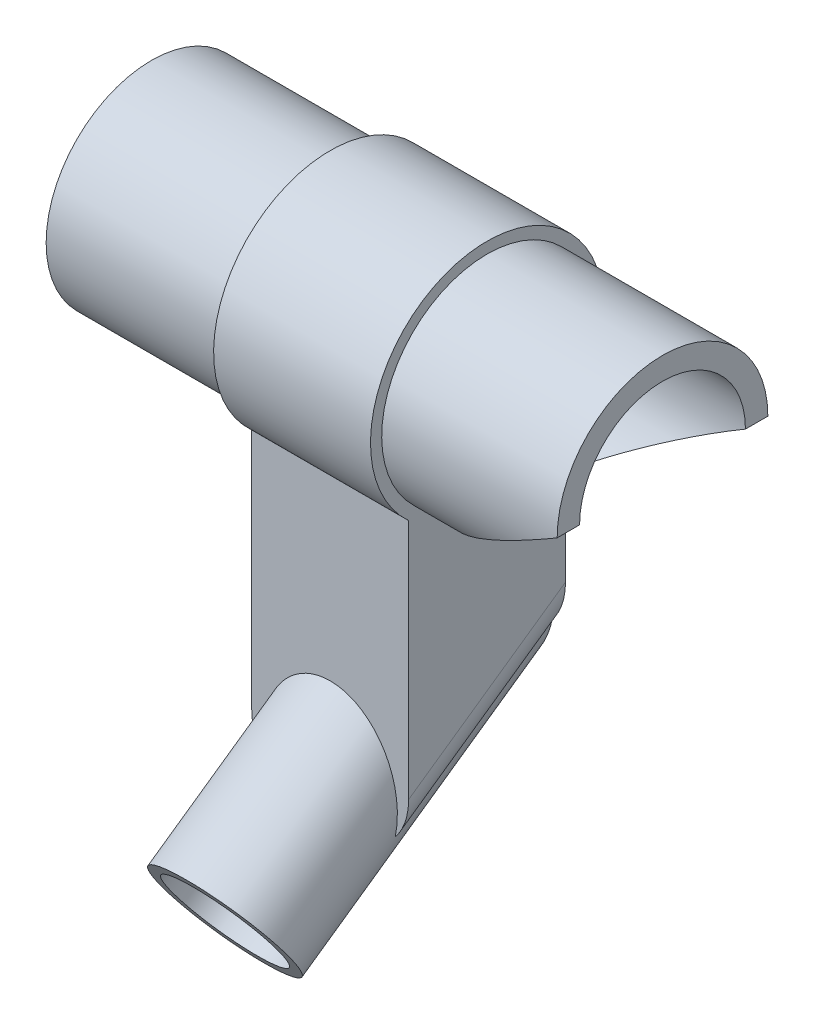
ISO-10303-21;
HEADER;
FILE_DESCRIPTION(('STEP AP214'),'2;1');
FILE_NAME('part.step','',(''),(''),'','','');
FILE_SCHEMA(('AUTOMOTIVE_DESIGN { 1 0 10303 214 1 1 1 1 }'));
ENDSEC;
DATA;
#1=APPLICATION_CONTEXT('core data for automotive mechanical design processes');
#2=APPLICATION_PROTOCOL_DEFINITION('international standard','automotive_design',2000,#1);
#3=PRODUCT_CONTEXT('',#1,'mechanical');
#4=PRODUCT('Part','Part','',(#3));
#5=PRODUCT_RELATED_PRODUCT_CATEGORY('part','',(#4));
#6=PRODUCT_DEFINITION_FORMATION('','',#4);
#7=PRODUCT_DEFINITION_CONTEXT('part definition',#1,'design');
#8=PRODUCT_DEFINITION('design','',#6,#7);
#9=PRODUCT_DEFINITION_SHAPE('','',#8);
#10=(LENGTH_UNIT() NAMED_UNIT(*) SI_UNIT(.MILLI.,.METRE.));
#11=(NAMED_UNIT(*) PLANE_ANGLE_UNIT() SI_UNIT($,.RADIAN.));
#12=(NAMED_UNIT(*) SI_UNIT($,.STERADIAN.) SOLID_ANGLE_UNIT());
#13=UNCERTAINTY_MEASURE_WITH_UNIT(LENGTH_MEASURE(1.E-05),#10,'distance_accuracy_value','');
#14=(GEOMETRIC_REPRESENTATION_CONTEXT(3) GLOBAL_UNCERTAINTY_ASSIGNED_CONTEXT((#13)) GLOBAL_UNIT_ASSIGNED_CONTEXT((#10,
#11,#12)) REPRESENTATION_CONTEXT('',''));
#15=CARTESIAN_POINT('',(0.,0.,0.));
#16=DIRECTION('',(0.,0.,1.));
#17=DIRECTION('',(1.,0.,0.));
#18=AXIS2_PLACEMENT_3D('',#15,#16,#17);
#19=CARTESIAN_POINT('',(114.,0.,0.));
#20=DIRECTION('',(-1.,0.,0.));
#21=DIRECTION('',(0.,0.,1.));
#22=AXIS2_PLACEMENT_3D('',#19,#20,#21);
#23=CYLINDRICAL_SURFACE('',#22,23.5);
#24=CARTESIAN_POINT('',(114.,0.,0.));
#25=DIRECTION('',(-0.506549048630866,0.862211146605728,0.));
#26=DIRECTION('',(-0.862211146605728,-0.506549048630866,0.));
#27=AXIS2_PLACEMENT_3D('',#24,#25,#26);
#28=ELLIPSE('',#27,46.3923485070545,23.5);
#29=CARTESIAN_POINT('',(114.,0.,-23.5));
#30=VERTEX_POINT('',#29);
#31=CARTESIAN_POINT('',(74.857864376269,-22.996004678942,-4.84084381137014));
#32=VERTEX_POINT('',#31);
#33=EDGE_CURVE('E217',#30,#32,#28,.T.);
#34=ORIENTED_EDGE('',*,*,#33,.T.);
#35=CARTESIAN_POINT('',(74.857864376269,0.,0.));
#36=DIRECTION('',(1.,0.,0.));
#37=DIRECTION('',(0.,0.,-1.));
#38=AXIS2_PLACEMENT_3D('',#35,#36,#37);
#39=CIRCLE('',#38,23.5);
#40=CARTESIAN_POINT('',(74.857864376269,-22.996004678942,4.84084381137014));
#41=VERTEX_POINT('',#40);
#42=EDGE_CURVE('E156',#32,#41,#39,.T.);
#43=ORIENTED_EDGE('',*,*,#42,.T.);
#44=CARTESIAN_POINT('',(114.,0.,23.5));
#45=VERTEX_POINT('',#44);
#46=EDGE_CURVE('E212',#41,#45,#28,.T.);
#47=ORIENTED_EDGE('',*,*,#46,.T.);
#48=CARTESIAN_POINT('',(114.,0.,0.));
#49=DIRECTION('',(1.,0.,0.));
#50=DIRECTION('',(0.,0.,-1.));
#51=AXIS2_PLACEMENT_3D('',#48,#49,#50);
#52=CIRCLE('',#51,23.5);
#53=EDGE_CURVE('E209',#30,#45,#52,.T.);
#54=ORIENTED_EDGE('',*,*,#53,.F.);
#55=EDGE_LOOP('',(#34,#43,#47,#54));
#56=FACE_BOUND('',#55,.T.);
#57=ADVANCED_FACE('F41',(#56),#23,.T.);
#58=CARTESIAN_POINT('',(57.3578643762691,-53.5284712729791,-16.3830408857798));
#59=DIRECTION('',(0.,-0.573576436351047,0.819152044288991));
#60=DIRECTION('',(0.,-0.819152044288991,-0.573576436351047));
#61=AXIS2_PLACEMENT_3D('',#58,#59,#60);
#62=CYLINDRICAL_SURFACE('',#61,15.);
#63=DIRECTION('',(0.,-0.573576436351047,0.819152044288991));
#64=VECTOR('',#63,1.);
#65=CARTESIAN_POINT('',(42.8355306649927,-56.6045833726704,-18.5369577663619));
#66=LINE('',#65,#64);
#67=CARTESIAN_POINT('',(42.8355306649925,-81.8379328548221,17.5));
#68=VERTEX_POINT('',#67);
#69=CARTESIAN_POINT('',(42.8355306649927,-57.3306690174822,-17.5));
#70=VERTEX_POINT('',#69);
#71=EDGE_CURVE('E127',#68,#70,#66,.F.);
#72=ORIENTED_EDGE('',*,*,#71,.T.);
#73=CARTESIAN_POINT('',(57.3578643762691,-52.74636808133,-17.5));
#74=DIRECTION('',(0.,0.,1.));
#75=DIRECTION('',(0.,-1.,0.));
#76=AXIS2_PLACEMENT_3D('',#73,#74,#75);
#77=ELLIPSE('',#76,18.3116188314219,15.);
#78=CARTESIAN_POINT('',(71.8829038712057,-57.3178759650481,-17.5));
#79=VERTEX_POINT('',#78);
#80=EDGE_CURVE('E113',#70,#79,#77,.T.);
#81=ORIENTED_EDGE('',*,*,#80,.T.);
#82=DIRECTION('',(0.,-0.573576436351047,0.819152044288991));
#83=VECTOR('',#82,1.);
#84=CARTESIAN_POINT('',(71.8829038712057,-56.5959991056399,-18.530946997877));
#85=LINE('',#84,#83);
#86=CARTESIAN_POINT('',(71.8829038712055,-81.825139802388,17.5));
#87=VERTEX_POINT('',#86);
#88=EDGE_CURVE('E125',#79,#87,#85,.T.);
#89=ORIENTED_EDGE('',*,*,#88,.T.);
#90=CARTESIAN_POINT('',(57.357864376269,-77.25363191867,17.5));
#91=DIRECTION('',(0.,0.,1.));
#92=DIRECTION('',(0.,-1.,0.));
#93=AXIS2_PLACEMENT_3D('',#90,#91,#92);
#94=ELLIPSE('',#93,18.3116188314219,15.);
#95=EDGE_CURVE('E136',#68,#87,#94,.F.);
#96=ORIENTED_EDGE('',*,*,#95,.F.);
#97=EDGE_LOOP('',(#72,#81,#89,#96));
#98=FACE_BOUND('',#97,.T.);
#99=CARTESIAN_POINT('',(57.3578643762689,-93.6788218175524,40.9576022144495));
#100=DIRECTION('',(0.,0.573576436351047,-0.819152044288991));
#101=DIRECTION('',(0.,0.819152044288991,0.573576436351047));
#102=AXIS2_PLACEMENT_3D('',#99,#100,#101);
#103=CIRCLE('',#102,15.);
#104=CARTESIAN_POINT('',(57.3578643762689,-81.3915411532175,49.5612487597153));
#105=VERTEX_POINT('',#104);
#106=EDGE_CURVE('E162',#105,#105,#103,.T.);
#107=ORIENTED_EDGE('',*,*,#106,.T.);
#108=EDGE_LOOP('',(#107));
#109=FACE_BOUND('',#108,.T.);
#110=ADVANCED_FACE('F122',(#98,#109),#62,.T.);
#111=CARTESIAN_POINT('',(57.3578643762691,-53.5284712729791,-16.3830408857798));
#112=DIRECTION('',(0.,-0.573576436351047,0.819152044288991));
#113=DIRECTION('',(0.,-0.819152044288991,-0.573576436351047));
#114=AXIS2_PLACEMENT_3D('',#111,#112,#113);
#115=CYLINDRICAL_SURFACE('',#114,12.5);
#116=CARTESIAN_POINT('',(57.3578643762689,-93.6788218175524,40.9576022144495));
#117=DIRECTION('',(0.,0.573576436351047,-0.819152044288991));
#118=DIRECTION('',(0.,0.819152044288991,0.573576436351047));
#119=AXIS2_PLACEMENT_3D('',#116,#117,#118);
#120=CIRCLE('',#119,12.5);
#121=CARTESIAN_POINT('',(57.3578643762689,-83.43942126394,48.1273076688376));
#122=VERTEX_POINT('',#121);
#123=EDGE_CURVE('E513',#122,#122,#120,.T.);
#124=ORIENTED_EDGE('',*,*,#123,.F.);
#125=EDGE_LOOP('',(#124));
#126=FACE_BOUND('',#125,.T.);
#127=CARTESIAN_POINT('',(57.357864376269,-77.25363191867,17.5));
#128=DIRECTION('',(0.,0.,1.));
#129=DIRECTION('',(0.,-1.,0.));
#130=AXIS2_PLACEMENT_3D('',#127,#128,#129);
#131=ELLIPSE('',#130,15.2596823595182,12.5);
#132=CARTESIAN_POINT('',(57.3578643762689,-92.5133142781882,17.5));
#133=VERTEX_POINT('',#132);
#134=EDGE_CURVE('E228',#133,#133,#131,.F.);
#135=ORIENTED_EDGE('',*,*,#134,.T.);
#136=EDGE_LOOP('',(#135));
#137=FACE_BOUND('',#136,.T.);
#138=ADVANCED_FACE('F249',(#126,#137),#115,.F.);
#139=CARTESIAN_POINT('',(39.857864376269,-65.,17.5));
#140=DIRECTION('',(0.,0.,1.));
#141=DIRECTION('',(1.,0.,0.));
#142=AXIS2_PLACEMENT_3D('',#139,#140,#141);
#143=PLANE('',#142);
#144=ORIENTED_EDGE('',*,*,#134,.F.);
#145=EDGE_LOOP('',(#144));
#146=FACE_BOUND('',#145,.T.);
#147=ADVANCED_FACE('F275',(#146),#143,.T.);
#148=CARTESIAN_POINT('',(5.,0.,0.));
#149=DIRECTION('',(-1.,0.,0.));
#150=DIRECTION('',(0.,0.,1.));
#151=AXIS2_PLACEMENT_3D('',#148,#149,#150);
#152=CYLINDRICAL_SURFACE('',#151,5.37499999999997);
#153=CARTESIAN_POINT('',(0.,0.,0.));
#154=DIRECTION('',(-1.,0.,0.));
#155=DIRECTION('',(0.,0.,1.));
#156=AXIS2_PLACEMENT_3D('',#153,#154,#155);
#157=CIRCLE('',#156,5.37499999999997);
#158=CARTESIAN_POINT('',(0.,0.,5.37499999999997));
#159=VERTEX_POINT('',#158);
#160=EDGE_CURVE('E199',#159,#159,#157,.T.);
#161=ORIENTED_EDGE('',*,*,#160,.T.);
#162=EDGE_LOOP('',(#161));
#163=FACE_BOUND('',#162,.T.);
#164=CARTESIAN_POINT('',(2.5,0.,0.));
#165=DIRECTION('',(1.,0.,0.));
#166=DIRECTION('',(0.,0.,-1.));
#167=AXIS2_PLACEMENT_3D('',#164,#165,#166);
#168=CIRCLE('',#167,5.37499999999997);
#169=CARTESIAN_POINT('',(2.5,0.,-5.37499999999997));
#170=VERTEX_POINT('',#169);
#171=EDGE_CURVE('E169',#170,#170,#168,.F.);
#172=ORIENTED_EDGE('',*,*,#171,.F.);
#173=EDGE_LOOP('',(#172));
#174=FACE_BOUND('',#173,.T.);
#175=ADVANCED_FACE('F309',(#163,#174),#152,.F.);
#176=CARTESIAN_POINT('',(114.,0.,0.));
#177=DIRECTION('',(-1.,0.,0.));
#178=DIRECTION('',(0.,0.,1.));
#179=AXIS2_PLACEMENT_3D('',#176,#177,#178);
#180=CYLINDRICAL_SURFACE('',#179,18.5);
#181=CARTESIAN_POINT('',(5.,0.,0.));
#182=DIRECTION('',(-1.,0.,0.));
#183=DIRECTION('',(0.,0.,1.));
#184=AXIS2_PLACEMENT_3D('',#181,#182,#183);
#185=CIRCLE('',#184,18.5);
#186=CARTESIAN_POINT('',(5.,0.,18.5));
#187=VERTEX_POINT('',#186);
#188=EDGE_CURVE('E204',#187,#187,#185,.T.);
#189=ORIENTED_EDGE('',*,*,#188,.T.);
#190=EDGE_LOOP('',(#189));
#191=FACE_BOUND('',#190,.T.);
#192=CARTESIAN_POINT('',(114.,0.,0.));
#193=DIRECTION('',(-0.506549048630866,0.862211146605728,0.));
#194=DIRECTION('',(-0.862211146605728,-0.506549048630866,0.));
#195=AXIS2_PLACEMENT_3D('',#192,#193,#194);
#196=ELLIPSE('',#195,36.521636058745,18.5);
#197=CARTESIAN_POINT('',(114.,0.,-18.5));
#198=VERTEX_POINT('',#197);
#199=CARTESIAN_POINT('',(114.,0.,18.5));
#200=VERTEX_POINT('',#199);
#201=EDGE_CURVE('E174',#198,#200,#196,.T.);
#202=ORIENTED_EDGE('',*,*,#201,.F.);
#203=CARTESIAN_POINT('',(114.,0.,0.));
#204=DIRECTION('',(1.,0.,0.));
#205=DIRECTION('',(0.,0.,-1.));
#206=AXIS2_PLACEMENT_3D('',#203,#204,#205);
#207=CIRCLE('',#206,18.5);
#208=EDGE_CURVE('E205',#198,#200,#207,.T.);
#209=ORIENTED_EDGE('',*,*,#208,.T.);
#210=EDGE_LOOP('',(#202,#209));
#211=FACE_BOUND('',#210,.T.);
#212=ADVANCED_FACE('F311',(#191,#211),#180,.F.);
#213=CARTESIAN_POINT('',(114.,0.,0.));
#214=DIRECTION('',(1.,0.,0.));
#215=DIRECTION('',(0.,0.,-1.));
#216=AXIS2_PLACEMENT_3D('',#213,#214,#215);
#217=PLANE('',#216);
#218=DIRECTION('',(0.,0.,1.));
#219=VECTOR('',#218,1.);
#220=CARTESIAN_POINT('',(114.,0.,-23.5));
#221=LINE('',#220,#219);
#222=EDGE_CURVE('E172',#30,#198,#221,.T.);
#223=ORIENTED_EDGE('',*,*,#222,.F.);
#224=ORIENTED_EDGE('',*,*,#53,.T.);
#225=EDGE_CURVE('E175',#200,#45,#221,.T.);
#226=ORIENTED_EDGE('',*,*,#225,.F.);
#227=ORIENTED_EDGE('',*,*,#208,.F.);
#228=EDGE_LOOP('',(#223,#224,#226,#227));
#229=FACE_BOUND('',#228,.T.);
#230=ADVANCED_FACE('F263',(#229),#217,.T.);
#231=CARTESIAN_POINT('',(0.,0.,0.));
#232=DIRECTION('',(1.,0.,0.));
#233=DIRECTION('',(0.,0.,-1.));
#234=AXIS2_PLACEMENT_3D('',#231,#232,#233);
#235=PLANE('',#234);
#236=CARTESIAN_POINT('',(0.,0.,0.));
#237=DIRECTION('',(1.,0.,0.));
#238=DIRECTION('',(0.,0.,-1.));
#239=AXIS2_PLACEMENT_3D('',#236,#237,#238);
#240=CIRCLE('',#239,23.5);
#241=CARTESIAN_POINT('',(0.,0.,23.5));
#242=VERTEX_POINT('',#241);
#243=EDGE_CURVE('E208',#242,#242,#240,.T.);
#244=ORIENTED_EDGE('',*,*,#243,.F.);
#245=EDGE_LOOP('',(#244));
#246=FACE_BOUND('',#245,.T.);
#247=ORIENTED_EDGE('',*,*,#160,.F.);
#248=EDGE_LOOP('',(#247));
#249=FACE_BOUND('',#248,.T.);
#250=CARTESIAN_POINT('',(0.,6.35166331923901,-12.4762323269907));
#251=DIRECTION('',(-1.,0.,0.));
#252=DIRECTION('',(0.,0.,1.));
#253=AXIS2_PLACEMENT_3D('',#250,#251,#252);
#254=CIRCLE('',#253,1.24999999999999);
#255=CARTESIAN_POINT('',(0.,6.35166331923901,-11.2262323269907));
#256=VERTEX_POINT('',#255);
#257=EDGE_CURVE('E193',#256,#256,#254,.T.);
#258=ORIENTED_EDGE('',*,*,#257,.F.);
#259=EDGE_LOOP('',(#258));
#260=FACE_BOUND('',#259,.T.);
#261=CARTESIAN_POINT('',(0.,-12.4762323270948,-6.35166331923473));
#262=DIRECTION('',(-1.,0.,0.));
#263=DIRECTION('',(0.,0.,1.));
#264=AXIS2_PLACEMENT_3D('',#261,#262,#263);
#265=CIRCLE('',#264,1.24999999999999);
#266=CARTESIAN_POINT('',(0.,-12.4762323270948,-5.10166331923475));
#267=VERTEX_POINT('',#266);
#268=EDGE_CURVE('E187',#267,#267,#265,.T.);
#269=ORIENTED_EDGE('',*,*,#268,.F.);
#270=EDGE_LOOP('',(#269));
#271=FACE_BOUND('',#270,.T.);
#272=CARTESIAN_POINT('',(0.,-6.35166331933882,12.4762323270991));
#273=DIRECTION('',(-1.,0.,0.));
#274=DIRECTION('',(0.,0.,1.));
#275=AXIS2_PLACEMENT_3D('',#272,#273,#274);
#276=CIRCLE('',#275,1.24999999999999);
#277=CARTESIAN_POINT('',(0.,-6.35166331933882,13.726232327099));
#278=VERTEX_POINT('',#277);
#279=EDGE_CURVE('E181',#278,#278,#276,.T.);
#280=ORIENTED_EDGE('',*,*,#279,.F.);
#281=EDGE_LOOP('',(#280));
#282=FACE_BOUND('',#281,.T.);
#283=CARTESIAN_POINT('',(0.,12.476232326995,6.35166331934309));
#284=DIRECTION('',(-1.,0.,0.));
#285=DIRECTION('',(0.,0.,1.));
#286=AXIS2_PLACEMENT_3D('',#283,#284,#285);
#287=CIRCLE('',#286,1.24999999999999);
#288=CARTESIAN_POINT('',(0.,12.476232326995,7.60166331934308));
#289=VERTEX_POINT('',#288);
#290=EDGE_CURVE('E177',#289,#289,#287,.T.);
#291=ORIENTED_EDGE('',*,*,#290,.F.);
#292=EDGE_LOOP('',(#291));
#293=FACE_BOUND('',#292,.T.);
#294=ADVANCED_FACE('F253',(#246,#249,#260,#271,#282,#293),#235,.F.);
#295=CARTESIAN_POINT('',(39.857864376269,0.,0.));
#296=DIRECTION('',(-1.,0.,0.));
#297=DIRECTION('',(0.,0.,1.));
#298=AXIS2_PLACEMENT_3D('',#295,#296,#297);
#299=CIRCLE('',#298,23.5);
#300=CARTESIAN_POINT('',(39.8578643762691,0.,23.5));
#301=VERTEX_POINT('',#300);
#302=EDGE_CURVE('E225',#301,#301,#299,.T.);
#303=CARTESIAN_POINT('',(0.,0.,23.5));
#304=CARTESIAN_POINT('',(0.415186087252805,0.,23.5));
#305=CARTESIAN_POINT('',(0.83037217450561,0.,23.5));
#306=CARTESIAN_POINT('',(1.66074434901121,0.,23.5));
#307=CARTESIAN_POINT('',(2.07593043626401,0.,23.5));
#308=CARTESIAN_POINT('',(2.90630261076962,0.,23.5));
#309=CARTESIAN_POINT('',(3.32148869802242,0.,23.5));
#310=CARTESIAN_POINT('',(4.15186087252803,0.,23.5));
#311=CARTESIAN_POINT('',(4.56704695978083,0.,23.5));
#312=CARTESIAN_POINT('',(5.39741913428643,0.,23.5));
#313=CARTESIAN_POINT('',(5.81260522153924,0.,23.5));
#314=CARTESIAN_POINT('',(6.64297739604484,0.,23.5));
#315=CARTESIAN_POINT('',(7.05816348329764,0.,23.5));
#316=CARTESIAN_POINT('',(7.88853565780325,0.,23.5));
#317=CARTESIAN_POINT('',(8.30372174505605,0.,23.5));
#318=CARTESIAN_POINT('',(9.13409391956166,0.,23.5));
#319=CARTESIAN_POINT('',(9.54928000681446,0.,23.5));
#320=CARTESIAN_POINT('',(10.3796521813201,0.,23.5));
#321=CARTESIAN_POINT('',(10.7948382685729,0.,23.5));
#322=CARTESIAN_POINT('',(11.6252104430785,0.,23.5));
#323=CARTESIAN_POINT('',(12.0403965303313,0.,23.5));
#324=CARTESIAN_POINT('',(12.8707687048369,0.,23.5));
#325=CARTESIAN_POINT('',(13.2859547920897,0.,23.5));
#326=CARTESIAN_POINT('',(14.1163269665953,0.,23.5));
#327=CARTESIAN_POINT('',(14.5315130538481,0.,23.5));
#328=CARTESIAN_POINT('',(15.3618852283537,0.,23.5));
#329=CARTESIAN_POINT('',(15.7770713156065,0.,23.5));
#330=CARTESIAN_POINT('',(16.6074434901121,0.,23.5));
#331=CARTESIAN_POINT('',(17.0226295773649,0.,23.5));
#332=CARTESIAN_POINT('',(17.8530017518705,0.,23.5));
#333=CARTESIAN_POINT('',(18.2681878391233,0.,23.5));
#334=CARTESIAN_POINT('',(19.0985600136289,0.,23.5));
#335=CARTESIAN_POINT('',(19.5137461008817,0.,23.5));
#336=CARTESIAN_POINT('',(20.3441182753873,0.,23.5));
#337=CARTESIAN_POINT('',(20.7593043626401,0.,23.5));
#338=CARTESIAN_POINT('',(21.5896765371457,0.,23.5));
#339=CARTESIAN_POINT('',(22.0048626243985,0.,23.5));
#340=CARTESIAN_POINT('',(22.8352347989041,0.,23.5));
#341=CARTESIAN_POINT('',(23.250420886157,0.,23.5));
#342=CARTESIAN_POINT('',(24.0807930606626,0.,23.5));
#343=CARTESIAN_POINT('',(24.4959791479154,0.,23.5));
#344=CARTESIAN_POINT('',(25.326351322421,0.,23.5));
#345=CARTESIAN_POINT('',(25.7415374096738,0.,23.5));
#346=CARTESIAN_POINT('',(26.5719095841794,0.,23.5));
#347=CARTESIAN_POINT('',(26.9870956714322,0.,23.5));
#348=CARTESIAN_POINT('',(27.8174678459378,0.,23.5));
#349=CARTESIAN_POINT('',(28.2326539331906,0.,23.5));
#350=CARTESIAN_POINT('',(29.0630261076962,0.,23.5));
#351=CARTESIAN_POINT('',(29.478212194949,0.,23.5));
#352=CARTESIAN_POINT('',(30.3085843694546,0.,23.5));
#353=CARTESIAN_POINT('',(30.7237704567074,0.,23.5));
#354=CARTESIAN_POINT('',(31.554142631213,0.,23.5));
#355=CARTESIAN_POINT('',(31.9693287184658,0.,23.5));
#356=CARTESIAN_POINT('',(32.7997008929714,0.,23.5));
#357=CARTESIAN_POINT('',(33.2148869802242,0.,23.5));
#358=CARTESIAN_POINT('',(34.0452591547298,0.,23.5));
#359=CARTESIAN_POINT('',(34.4604452419826,0.,23.5));
#360=CARTESIAN_POINT('',(35.2908174164882,0.,23.5));
#361=CARTESIAN_POINT('',(35.706003503741,0.,23.5));
#362=CARTESIAN_POINT('',(36.5363756782466,0.,23.5));
#363=CARTESIAN_POINT('',(36.9515617654994,0.,23.5));
#364=CARTESIAN_POINT('',(37.7819339400051,0.,23.5));
#365=CARTESIAN_POINT('',(38.1971200272579,0.,23.5));
#366=CARTESIAN_POINT('',(39.0274922017635,0.,23.5));
#367=CARTESIAN_POINT('',(39.4426782890163,0.,23.5));
#368=CARTESIAN_POINT('',(39.8578643762691,0.,23.5));
#369=B_SPLINE_CURVE_WITH_KNOTS('',3,(#303,#304,#305,#306,#307,#308,#309,#310,#311,#312,#313,
#314,#315,#316,#317,#318,#319,#320,#321,#322,#323,#324,#325,#326,#327,#328,#329,#330,#331,#332,
#333,#334,#335,#336,#337,#338,#339,#340,#341,#342,#343,#344,#345,#346,#347,#348,#349,#350,#351,
#352,#353,#354,#355,#356,#357,#358,#359,#360,#361,#362,#363,#364,#365,#366,#367,#368),
.UNSPECIFIED.,.F.,.F.,(4,2,2,2,2,2,2,2,2,2,2,2,2,2,2,2,2,2,2,2,2,2,2,2,2,2,2,2,2,2,2,2,4),(0.,
1.24555826175841,2.49111652351681,3.73667478527523,4.98223304703363,6.22779130879204,
7.47334957055044,8.71890783230886,9.96446609406726,11.2100243558257,12.4555826175841,
13.7011408793425,14.9466991411009,16.1922574028593,17.4378156646177,18.6833739263761,
19.9289321881345,21.1744904498929,22.4200487116513,23.6656069734098,24.9111652351682,
26.1567234969266,27.402281758685,28.6478400204434,29.8933982822018,31.1389565439602,
32.3845148057186,33.630073067477,34.8756313292354,36.1211895909938,37.3667478527522,
38.6123061145107,39.8578643762691),.UNSPECIFIED.);
#370=EDGE_CURVE('BSEAM243',#242,#301,#369,.T.);
#371=ORIENTED_EDGE('',*,*,#243,.T.);
#372=ORIENTED_EDGE('',*,*,#302,.T.);
#373=ORIENTED_EDGE('',*,*,#370,.T.);
#374=ORIENTED_EDGE('',*,*,#370,.F.);
#375=EDGE_LOOP('',(#371,#373,#372,#374));
#376=FACE_BOUND('',#375,.T.);
#377=ADVANCED_FACE('F243',(#376),#23,.T.);
#378=CARTESIAN_POINT('',(5.,0.,0.));
#379=DIRECTION('',(-1.,0.,0.));
#380=DIRECTION('',(0.,0.,1.));
#381=AXIS2_PLACEMENT_3D('',#378,#379,#380);
#382=PLANE('',#381);
#383=CARTESIAN_POINT('',(5.,-4.99034579325564E-11,5.41864209752108E-11));
#384=DIRECTION('',(1.,0.,0.));
#385=DIRECTION('',(0.,0.,-1.));
#386=AXIS2_PLACEMENT_3D('',#383,#384,#385);
#387=CIRCLE('',#386,11.5000000000663);
#388=CARTESIAN_POINT('',(5.,-4.99034579325564E-11,-11.5000000000121));
#389=VERTEX_POINT('',#388);
#390=EDGE_CURVE('E165',#389,#389,#387,.T.);
#391=ORIENTED_EDGE('',*,*,#390,.F.);
#392=EDGE_LOOP('',(#391));
#393=FACE_BOUND('',#392,.T.);
#394=CARTESIAN_POINT('',(5.,6.35166331923901,-12.4762323269907));
#395=DIRECTION('',(-1.,0.,0.));
#396=DIRECTION('',(0.,0.,1.));
#397=AXIS2_PLACEMENT_3D('',#394,#395,#396);
#398=CIRCLE('',#397,1.24999999999999);
#399=CARTESIAN_POINT('',(5.,6.35166331923901,-11.2262323269907));
#400=VERTEX_POINT('',#399);
#401=EDGE_CURVE('E196',#400,#400,#398,.T.);
#402=ORIENTED_EDGE('',*,*,#401,.T.);
#403=EDGE_LOOP('',(#402));
#404=FACE_BOUND('',#403,.T.);
#405=CARTESIAN_POINT('',(5.,-12.4762323270948,-6.35166331923473));
#406=DIRECTION('',(-1.,0.,0.));
#407=DIRECTION('',(0.,0.,1.));
#408=AXIS2_PLACEMENT_3D('',#405,#406,#407);
#409=CIRCLE('',#408,1.24999999999999);
#410=CARTESIAN_POINT('',(5.,-12.4762323270948,-5.10166331923475));
#411=VERTEX_POINT('',#410);
#412=EDGE_CURVE('E190',#411,#411,#409,.T.);
#413=ORIENTED_EDGE('',*,*,#412,.T.);
#414=EDGE_LOOP('',(#413));
#415=FACE_BOUND('',#414,.T.);
#416=CARTESIAN_POINT('',(5.,-6.35166331933882,12.4762323270991));
#417=DIRECTION('',(-1.,0.,0.));
#418=DIRECTION('',(0.,0.,1.));
#419=AXIS2_PLACEMENT_3D('',#416,#417,#418);
#420=CIRCLE('',#419,1.24999999999999);
#421=CARTESIAN_POINT('',(5.,-6.35166331933882,13.726232327099));
#422=VERTEX_POINT('',#421);
#423=EDGE_CURVE('E184',#422,#422,#420,.T.);
#424=ORIENTED_EDGE('',*,*,#423,.T.);
#425=EDGE_LOOP('',(#424));
#426=FACE_BOUND('',#425,.T.);
#427=CARTESIAN_POINT('',(5.,12.476232326995,6.35166331934309));
#428=DIRECTION('',(-1.,0.,0.));
#429=DIRECTION('',(0.,0.,1.));
#430=AXIS2_PLACEMENT_3D('',#427,#428,#429);
#431=CIRCLE('',#430,1.24999999999999);
#432=CARTESIAN_POINT('',(5.,12.476232326995,7.60166331934308));
#433=VERTEX_POINT('',#432);
#434=EDGE_CURVE('E178',#433,#433,#431,.T.);
#435=ORIENTED_EDGE('',*,*,#434,.T.);
#436=EDGE_LOOP('',(#435));
#437=FACE_BOUND('',#436,.T.);
#438=ORIENTED_EDGE('',*,*,#188,.F.);
#439=EDGE_LOOP('',(#438));
#440=FACE_BOUND('',#439,.T.);
#441=ADVANCED_FACE('F252',(#393,#404,#415,#426,#437,#440),#382,.F.);
#442=CARTESIAN_POINT('',(5.,6.35166331923901,-12.4762323269907));
#443=DIRECTION('',(-1.,0.,0.));
#444=DIRECTION('',(0.,0.,1.));
#445=AXIS2_PLACEMENT_3D('',#442,#443,#444);
#446=CYLINDRICAL_SURFACE('',#445,1.24999999999999);
#447=ORIENTED_EDGE('',*,*,#401,.F.);
#448=EDGE_LOOP('',(#447));
#449=FACE_BOUND('',#448,.T.);
#450=ORIENTED_EDGE('',*,*,#257,.T.);
#451=EDGE_LOOP('',(#450));
#452=FACE_BOUND('',#451,.T.);
#453=ADVANCED_FACE('F259',(#449,#452),#446,.F.);
#454=CARTESIAN_POINT('',(5.,-12.4762323270948,-6.35166331923473));
#455=DIRECTION('',(-1.,0.,0.));
#456=DIRECTION('',(0.,0.,1.));
#457=AXIS2_PLACEMENT_3D('',#454,#455,#456);
#458=CYLINDRICAL_SURFACE('',#457,1.24999999999999);
#459=ORIENTED_EDGE('',*,*,#412,.F.);
#460=EDGE_LOOP('',(#459));
#461=FACE_BOUND('',#460,.T.);
#462=ORIENTED_EDGE('',*,*,#268,.T.);
#463=EDGE_LOOP('',(#462));
#464=FACE_BOUND('',#463,.T.);
#465=ADVANCED_FACE('F301',(#461,#464),#458,.F.);
#466=CARTESIAN_POINT('',(5.,-6.35166331933882,12.4762323270991));
#467=DIRECTION('',(-1.,0.,0.));
#468=DIRECTION('',(0.,0.,1.));
#469=AXIS2_PLACEMENT_3D('',#466,#467,#468);
#470=CYLINDRICAL_SURFACE('',#469,1.24999999999999);
#471=ORIENTED_EDGE('',*,*,#423,.F.);
#472=EDGE_LOOP('',(#471));
#473=FACE_BOUND('',#472,.T.);
#474=ORIENTED_EDGE('',*,*,#279,.T.);
#475=EDGE_LOOP('',(#474));
#476=FACE_BOUND('',#475,.T.);
#477=ADVANCED_FACE('F297',(#473,#476),#470,.F.);
#478=CARTESIAN_POINT('',(5.,12.476232326995,6.35166331934309));
#479=DIRECTION('',(-1.,0.,0.));
#480=DIRECTION('',(0.,0.,1.));
#481=AXIS2_PLACEMENT_3D('',#478,#479,#480);
#482=CYLINDRICAL_SURFACE('',#481,1.24999999999999);
#483=ORIENTED_EDGE('',*,*,#434,.F.);
#484=EDGE_LOOP('',(#483));
#485=FACE_BOUND('',#484,.T.);
#486=ORIENTED_EDGE('',*,*,#290,.T.);
#487=EDGE_LOOP('',(#486));
#488=FACE_BOUND('',#487,.T.);
#489=ADVANCED_FACE('F293',(#485,#488),#482,.F.);
#490=CARTESIAN_POINT('',(114.,0.,-23.5));
#491=DIRECTION('',(-0.506549048630866,0.862211146605728,0.));
#492=DIRECTION('',(-0.862211146605728,-0.506549048630866,0.));
#493=AXIS2_PLACEMENT_3D('',#490,#491,#492);
#494=PLANE('',#493);
#495=ORIENTED_EDGE('',*,*,#46,.F.);
#496=DIRECTION('',(0.,0.,-1.));
#497=VECTOR('',#496,1.);
#498=CARTESIAN_POINT('',(74.857864376269,-22.996004678942,-23.5));
#499=LINE('',#498,#497);
#500=EDGE_CURVE('E220',#41,#32,#499,.T.);
#501=ORIENTED_EDGE('',*,*,#500,.T.);
#502=ORIENTED_EDGE('',*,*,#33,.F.);
#503=ORIENTED_EDGE('',*,*,#222,.T.);
#504=ORIENTED_EDGE('',*,*,#201,.T.);
#505=ORIENTED_EDGE('',*,*,#225,.T.);
#506=EDGE_LOOP('',(#495,#501,#502,#503,#504,#505));
#507=FACE_BOUND('',#506,.T.);
#508=ADVANCED_FACE('F286',(#507),#494,.F.);
#509=CARTESIAN_POINT('',(2.5,-4.99034579325564E-11,5.41864209752108E-11));
#510=DIRECTION('',(1.,0.,0.));
#511=DIRECTION('',(0.,0.,-1.));
#512=AXIS2_PLACEMENT_3D('',#509,#510,#511);
#513=PLANE('',#512);
#514=CARTESIAN_POINT('',(2.5,-4.99034579325564E-11,5.41864209752108E-11));
#515=DIRECTION('',(1.,0.,0.));
#516=DIRECTION('',(0.,0.,-1.));
#517=AXIS2_PLACEMENT_3D('',#514,#515,#516);
#518=CIRCLE('',#517,11.5000000000663);
#519=CARTESIAN_POINT('',(2.5,-4.99034579325564E-11,-11.5000000000121));
#520=VERTEX_POINT('',#519);
#521=EDGE_CURVE('E166',#520,#520,#518,.T.);
#522=ORIENTED_EDGE('',*,*,#521,.T.);
#523=EDGE_LOOP('',(#522));
#524=FACE_BOUND('',#523,.T.);
#525=ORIENTED_EDGE('',*,*,#171,.T.);
#526=EDGE_LOOP('',(#525));
#527=FACE_BOUND('',#526,.T.);
#528=ADVANCED_FACE('F283',(#524,#527),#513,.T.);
#529=CARTESIAN_POINT('',(2.5,-4.99034579325564E-11,5.41864209752108E-11));
#530=DIRECTION('',(1.,0.,0.));
#531=DIRECTION('',(0.,0.,-1.));
#532=AXIS2_PLACEMENT_3D('',#529,#530,#531);
#533=CYLINDRICAL_SURFACE('',#532,11.5000000000663);
#534=ORIENTED_EDGE('',*,*,#521,.F.);
#535=EDGE_LOOP('',(#534));
#536=FACE_BOUND('',#535,.T.);
#537=ORIENTED_EDGE('',*,*,#390,.T.);
#538=EDGE_LOOP('',(#537));
#539=FACE_BOUND('',#538,.T.);
#540=ADVANCED_FACE('F281',(#536,#539),#533,.F.);
#541=CARTESIAN_POINT('',(74.857864376269,-65.,-17.5));
#542=DIRECTION('',(1.,0.,0.));
#543=DIRECTION('',(0.,0.,-1.));
#544=AXIS2_PLACEMENT_3D('',#541,#542,#543);
#545=PLANE('',#544);
#546=DIRECTION('',(0.,1.,0.));
#547=VECTOR('',#546,1.);
#548=CARTESIAN_POINT('',(74.857864376269,-65.,-17.5));
#549=LINE('',#548,#547);
#550=CARTESIAN_POINT('',(74.857864376269,-48.6298692710991,-17.5));
#551=VERTEX_POINT('',#550);
#552=CARTESIAN_POINT('',(74.857864376269,-19.2288845230294,-17.5));
#553=VERTEX_POINT('',#552);
#554=EDGE_CURVE('E115',#551,#553,#549,.T.);
#555=ORIENTED_EDGE('',*,*,#554,.T.);
#556=CARTESIAN_POINT('',(74.857864376269,0.,0.));
#557=DIRECTION('',(-1.,0.,0.));
#558=DIRECTION('',(0.,0.,1.));
#559=AXIS2_PLACEMENT_3D('',#556,#557,#558);
#560=CIRCLE('',#559,26.);
#561=CARTESIAN_POINT('',(74.857864376269,-19.2288845230294,17.5));
#562=VERTEX_POINT('',#561);
#563=EDGE_CURVE('E517',#562,#553,#560,.T.);
#564=ORIENTED_EDGE('',*,*,#563,.F.);
#565=DIRECTION('',(0.,1.,0.));
#566=VECTOR('',#565,1.);
#567=CARTESIAN_POINT('',(74.857864376269,-65.,17.5));
#568=LINE('',#567,#566);
#569=CARTESIAN_POINT('',(74.8578643762689,-73.137133108439,17.5));
#570=VERTEX_POINT('',#569);
#571=EDGE_CURVE('E154',#570,#562,#568,.T.);
#572=ORIENTED_EDGE('',*,*,#571,.F.);
#573=DIRECTION('',(0.,0.573576436351047,-0.819152044288991));
#574=VECTOR('',#573,1.);
#575=CARTESIAN_POINT('',(74.857864376269,-50.5619493105363,-14.7407037428115));
#576=LINE('',#575,#574);
#577=EDGE_CURVE('E133',#570,#551,#576,.T.);
#578=ORIENTED_EDGE('',*,*,#577,.T.);
#579=EDGE_LOOP('',(#555,#564,#572,#578));
#580=FACE_BOUND('',#579,.T.);
#581=ORIENTED_EDGE('',*,*,#42,.F.);
#582=ORIENTED_EDGE('',*,*,#500,.F.);
#583=EDGE_LOOP('',(#581,#582));
#584=FACE_BOUND('',#583,.T.);
#585=ADVANCED_FACE('F276',(#580,#584),#545,.T.);
#586=CARTESIAN_POINT('',(39.857864376269,-65.,-17.5));
#587=DIRECTION('',(0.,0.,-1.));
#588=DIRECTION('',(-1.,0.,0.));
#589=AXIS2_PLACEMENT_3D('',#586,#587,#588);
#590=PLANE('',#589);
#591=DIRECTION('',(-1.,0.,0.));
#592=VECTOR('',#591,1.);
#593=CARTESIAN_POINT('',(74.857864376269,-19.2288845230294,-17.5));
#594=LINE('',#593,#592);
#595=CARTESIAN_POINT('',(39.857864376269,-19.2288845230294,-17.5));
#596=VERTEX_POINT('',#595);
#597=EDGE_CURVE('E514',#553,#596,#594,.T.);
#598=ORIENTED_EDGE('',*,*,#597,.F.);
#599=ORIENTED_EDGE('',*,*,#554,.F.);
#600=CARTESIAN_POINT('',(64.8578643762691,-48.6298692710991,-17.5));
#601=DIRECTION('',(0.,0.,-1.));
#602=DIRECTION('',(0.,-1.,0.));
#603=AXIS2_PLACEMENT_3D('',#600,#601,#602);
#604=ELLIPSE('',#603,12.2077458876146,10.);
#605=EDGE_CURVE('E109',#551,#79,#604,.T.);
#606=ORIENTED_EDGE('',*,*,#605,.T.);
#607=ORIENTED_EDGE('',*,*,#80,.F.);
#608=CARTESIAN_POINT('',(49.8578643762691,-48.6394029993903,-17.5));
#609=DIRECTION('',(0.,0.,-1.));
#610=DIRECTION('',(0.,-1.,0.));
#611=AXIS2_PLACEMENT_3D('',#608,#609,#610);
#612=ELLIPSE('',#611,12.2077458876146,10.);
#613=CARTESIAN_POINT('',(39.8578643762691,-48.6394029993903,-17.5));
#614=VERTEX_POINT('',#613);
#615=EDGE_CURVE('E56',#70,#614,#612,.T.);
#616=ORIENTED_EDGE('',*,*,#615,.T.);
#617=DIRECTION('',(0.,1.,0.));
#618=VECTOR('',#617,1.);
#619=CARTESIAN_POINT('',(39.857864376269,-65.,-17.5));
#620=LINE('',#619,#618);
#621=EDGE_CURVE('E149',#614,#596,#620,.T.);
#622=ORIENTED_EDGE('',*,*,#621,.T.);
#623=EDGE_LOOP('',(#598,#599,#606,#607,#616,#622));
#624=FACE_BOUND('',#623,.T.);
#625=ADVANCED_FACE('F112',(#624),#590,.T.);
#626=CARTESIAN_POINT('',(39.857864376269,-65.,-17.5));
#627=DIRECTION('',(-1.,0.,0.));
#628=DIRECTION('',(0.,0.,1.));
#629=AXIS2_PLACEMENT_3D('',#626,#627,#628);
#630=PLANE('',#629);
#631=ORIENTED_EDGE('',*,*,#302,.F.);
#632=EDGE_LOOP('',(#631));
#633=FACE_BOUND('',#632,.T.);
#634=DIRECTION('',(0.,1.,0.));
#635=VECTOR('',#634,1.);
#636=CARTESIAN_POINT('',(39.857864376269,-65.,17.5));
#637=LINE('',#636,#635);
#638=CARTESIAN_POINT('',(39.8578643762689,-73.1466668367302,17.5));
#639=VERTEX_POINT('',#638);
#640=CARTESIAN_POINT('',(39.857864376269,-19.2288845230294,17.5));
#641=VERTEX_POINT('',#640);
#642=EDGE_CURVE('E148',#639,#641,#637,.T.);
#643=ORIENTED_EDGE('',*,*,#642,.T.);
#644=CARTESIAN_POINT('',(39.857864376269,0.,0.));
#645=DIRECTION('',(-1.,0.,0.));
#646=DIRECTION('',(0.,0.,1.));
#647=AXIS2_PLACEMENT_3D('',#644,#645,#646);
#648=CIRCLE('',#647,26.);
#649=EDGE_CURVE('E128',#641,#596,#648,.T.);
#650=ORIENTED_EDGE('',*,*,#649,.T.);
#651=ORIENTED_EDGE('',*,*,#621,.F.);
#652=DIRECTION('',(0.,0.573576436351047,-0.819152044288991));
#653=VECTOR('',#652,1.);
#654=CARTESIAN_POINT('',(39.857864376269,-75.0803574021484,20.2615963266581));
#655=LINE('',#654,#653);
#656=EDGE_CURVE('E49',#614,#639,#655,.F.);
#657=ORIENTED_EDGE('',*,*,#656,.T.);
#658=EDGE_LOOP('',(#643,#650,#651,#657));
#659=FACE_BOUND('',#658,.T.);
#660=ADVANCED_FACE('F146',(#633,#659),#630,.T.);
#661=DIRECTION('',(-1.,0.,0.));
#662=VECTOR('',#661,1.);
#663=CARTESIAN_POINT('',(74.857864376269,-19.2288845230294,17.5));
#664=LINE('',#663,#662);
#665=EDGE_CURVE('E11',#641,#562,#664,.F.);
#666=ORIENTED_EDGE('',*,*,#665,.F.);
#667=ORIENTED_EDGE('',*,*,#642,.F.);
#668=CARTESIAN_POINT('',(49.8578643762689,-73.1466668367302,17.5));
#669=DIRECTION('',(0.,0.,1.));
#670=DIRECTION('',(0.,-1.,0.));
#671=AXIS2_PLACEMENT_3D('',#668,#669,#670);
#672=ELLIPSE('',#671,12.2077458876146,10.);
#673=EDGE_CURVE('E61',#639,#68,#672,.T.);
#674=ORIENTED_EDGE('',*,*,#673,.T.);
#675=ORIENTED_EDGE('',*,*,#95,.T.);
#676=CARTESIAN_POINT('',(64.8578643762689,-73.137133108439,17.5));
#677=DIRECTION('',(0.,0.,1.));
#678=DIRECTION('',(0.,-1.,0.));
#679=AXIS2_PLACEMENT_3D('',#676,#677,#678);
#680=ELLIPSE('',#679,12.2077458876146,10.);
#681=EDGE_CURVE('E132',#87,#570,#680,.T.);
#682=ORIENTED_EDGE('',*,*,#681,.T.);
#683=ORIENTED_EDGE('',*,*,#571,.T.);
#684=EDGE_LOOP('',(#666,#667,#674,#675,#682,#683));
#685=FACE_BOUND('',#684,.T.);
#686=ADVANCED_FACE('F152',(#685),#143,.T.);
#687=CARTESIAN_POINT('',(57.3578643762689,-93.6788218175524,40.9576022144495));
#688=DIRECTION('',(0.,0.573576436351047,-0.819152044288991));
#689=DIRECTION('',(0.,0.819152044288991,0.573576436351047));
#690=AXIS2_PLACEMENT_3D('',#687,#688,#689);
#691=PLANE('',#690);
#692=ORIENTED_EDGE('',*,*,#106,.F.);
#693=EDGE_LOOP('',(#692));
#694=FACE_BOUND('',#693,.T.);
#695=ORIENTED_EDGE('',*,*,#123,.T.);
#696=EDGE_LOOP('',(#695));
#697=FACE_BOUND('',#696,.T.);
#698=ADVANCED_FACE('F239',(#694,#697),#691,.F.);
#699=CARTESIAN_POINT('',(64.857864376269,-50.7662591113261,-14.4489191080558));
#700=DIRECTION('',(0.,-0.573576436351047,0.819152044288991));
#701=DIRECTION('',(0.,-0.819152044288991,-0.573576436351047));
#702=AXIS2_PLACEMENT_3D('',#699,#700,#701);
#703=CYLINDRICAL_SURFACE('',#702,10.);
#704=ORIENTED_EDGE('',*,*,#88,.F.);
#705=ORIENTED_EDGE('',*,*,#605,.F.);
#706=ORIENTED_EDGE('',*,*,#577,.F.);
#707=ORIENTED_EDGE('',*,*,#681,.F.);
#708=EDGE_LOOP('',(#704,#705,#706,#707));
#709=FACE_BOUND('',#708,.T.);
#710=ADVANCED_FACE('F131',(#709),#703,.T.);
#711=CARTESIAN_POINT('',(49.857864376269,-50.7726563390299,-14.4533984951178));
#712=DIRECTION('',(0.,-0.573576436351047,0.819152044288991));
#713=DIRECTION('',(0.,-0.819152044288991,-0.573576436351047));
#714=AXIS2_PLACEMENT_3D('',#711,#712,#713);
#715=CYLINDRICAL_SURFACE('',#714,10.);
#716=ORIENTED_EDGE('',*,*,#615,.F.);
#717=ORIENTED_EDGE('',*,*,#71,.F.);
#718=ORIENTED_EDGE('',*,*,#673,.F.);
#719=ORIENTED_EDGE('',*,*,#656,.F.);
#720=EDGE_LOOP('',(#716,#717,#718,#719));
#721=FACE_BOUND('',#720,.T.);
#722=ADVANCED_FACE('F43',(#721),#715,.T.);
#723=CARTESIAN_POINT('',(74.857864376269,0.,0.));
#724=DIRECTION('',(-1.,0.,0.));
#725=DIRECTION('',(0.,0.,1.));
#726=AXIS2_PLACEMENT_3D('',#723,#724,#725);
#727=CYLINDRICAL_SURFACE('',#726,26.);
#728=ORIENTED_EDGE('',*,*,#563,.T.);
#729=ORIENTED_EDGE('',*,*,#597,.T.);
#730=ORIENTED_EDGE('',*,*,#649,.F.);
#731=ORIENTED_EDGE('',*,*,#665,.T.);
#732=EDGE_LOOP('',(#728,#729,#730,#731));
#733=FACE_BOUND('',#732,.T.);
#734=ADVANCED_FACE('F232',(#733),#727,.T.);
#735=CLOSED_SHELL('',(#57,#110,#138,#147,#175,#212,#230,#294,#377,#441,#453,#465,#477,#489,#508,
#528,#540,#585,#625,#660,#686,#698,#710,#722,#734));
#736=MANIFOLD_SOLID_BREP('B2',#735);
#737=ADVANCED_BREP_SHAPE_REPRESENTATION('',(#18,#736),#14);
#738=SHAPE_DEFINITION_REPRESENTATION(#9,#737);
ENDSEC;
END-ISO-10303-21;
